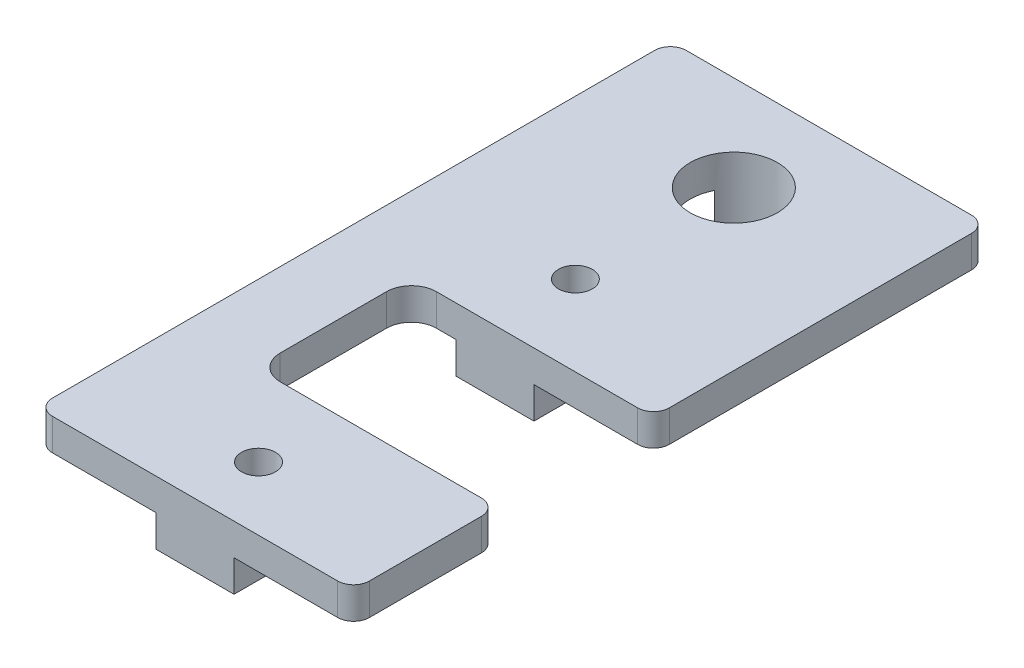
ISO-10303-21;
HEADER;
FILE_DESCRIPTION(('STEP AP214'),'2;1');
FILE_NAME('part.step','',(''),(''),'','','');
FILE_SCHEMA(('AUTOMOTIVE_DESIGN { 1 0 10303 214 1 1 1 1 }'));
ENDSEC;
DATA;
#1=APPLICATION_CONTEXT('core data for automotive mechanical design processes');
#2=APPLICATION_PROTOCOL_DEFINITION('international standard','automotive_design',2000,#1);
#3=PRODUCT_CONTEXT('',#1,'mechanical');
#4=PRODUCT('Part','Part','',(#3));
#5=PRODUCT_RELATED_PRODUCT_CATEGORY('part','',(#4));
#6=PRODUCT_DEFINITION_FORMATION('','',#4);
#7=PRODUCT_DEFINITION_CONTEXT('part definition',#1,'design');
#8=PRODUCT_DEFINITION('design','',#6,#7);
#9=PRODUCT_DEFINITION_SHAPE('','',#8);
#10=(LENGTH_UNIT() NAMED_UNIT(*) SI_UNIT(.MILLI.,.METRE.));
#11=(NAMED_UNIT(*) PLANE_ANGLE_UNIT() SI_UNIT($,.RADIAN.));
#12=(NAMED_UNIT(*) SI_UNIT($,.STERADIAN.) SOLID_ANGLE_UNIT());
#13=UNCERTAINTY_MEASURE_WITH_UNIT(LENGTH_MEASURE(1.E-05),#10,'distance_accuracy_value','');
#14=(GEOMETRIC_REPRESENTATION_CONTEXT(3) GLOBAL_UNCERTAINTY_ASSIGNED_CONTEXT((#13)) GLOBAL_UNIT_ASSIGNED_CONTEXT((#10,
#11,#12)) REPRESENTATION_CONTEXT('',''));
#15=CARTESIAN_POINT('',(0.,0.,0.));
#16=DIRECTION('',(0.,0.,1.));
#17=DIRECTION('',(1.,0.,0.));
#18=AXIS2_PLACEMENT_3D('',#15,#16,#17);
#19=CARTESIAN_POINT('',(19.775,0.,63.5));
#20=DIRECTION('',(1.,0.,0.));
#21=DIRECTION('',(0.,0.,-1.));
#22=AXIS2_PLACEMENT_3D('',#19,#20,#21);
#23=PLANE('',#22);
#24=DIRECTION('',(0.,1.,0.));
#25=VECTOR('',#24,1.);
#26=CARTESIAN_POINT('',(19.775,-3.175,7.5631942908063));
#27=LINE('',#26,#25);
#28=CARTESIAN_POINT('',(19.775,-3.175,7.5631942908063));
#29=VERTEX_POINT('',#28);
#30=CARTESIAN_POINT('',(19.775,0.,7.5631942908063));
#31=VERTEX_POINT('',#30);
#32=EDGE_CURVE('E293',#29,#31,#27,.T.);
#33=ORIENTED_EDGE('',*,*,#32,.F.);
#34=DIRECTION('',(0.,0.,-1.));
#35=VECTOR('',#34,1.);
#36=CARTESIAN_POINT('',(19.775,-3.175,63.5));
#37=LINE('',#36,#35);
#38=CARTESIAN_POINT('',(19.775,-3.175,0.));
#39=VERTEX_POINT('',#38);
#40=EDGE_CURVE('E311',#29,#39,#37,.T.);
#41=ORIENTED_EDGE('',*,*,#40,.T.);
#42=DIRECTION('',(0.,-1.,0.));
#43=VECTOR('',#42,1.);
#44=CARTESIAN_POINT('',(19.775,0.,0.));
#45=LINE('',#44,#43);
#46=CARTESIAN_POINT('',(19.775,0.,0.));
#47=VERTEX_POINT('',#46);
#48=EDGE_CURVE('E295',#47,#39,#45,.T.);
#49=ORIENTED_EDGE('',*,*,#48,.F.);
#50=DIRECTION('',(0.,0.,-1.));
#51=VECTOR('',#50,1.);
#52=CARTESIAN_POINT('',(19.775,0.,63.5));
#53=LINE('',#52,#51);
#54=EDGE_CURVE('E352',#31,#47,#53,.T.);
#55=ORIENTED_EDGE('',*,*,#54,.F.);
#56=EDGE_LOOP('',(#33,#41,#49,#55));
#57=FACE_BOUND('',#56,.T.);
#58=ADVANCED_FACE('F34',(#57),#23,.T.);
#59=CARTESIAN_POINT('',(19.775,-3.175,63.5));
#60=VERTEX_POINT('',#59);
#61=CARTESIAN_POINT('',(19.775,-3.175,49.1));
#62=VERTEX_POINT('',#61);
#63=EDGE_CURVE('E326',#60,#62,#37,.T.);
#64=ORIENTED_EDGE('',*,*,#63,.T.);
#65=DIRECTION('',(0.,1.,0.));
#66=VECTOR('',#65,1.);
#67=CARTESIAN_POINT('',(19.775,0.,49.1));
#68=LINE('',#67,#66);
#69=CARTESIAN_POINT('',(19.775,0.,49.1));
#70=VERTEX_POINT('',#69);
#71=EDGE_CURVE('E265',#62,#70,#68,.T.);
#72=ORIENTED_EDGE('',*,*,#71,.T.);
#73=CARTESIAN_POINT('',(19.775,0.,63.5));
#74=VERTEX_POINT('',#73);
#75=EDGE_CURVE('E353',#74,#70,#53,.T.);
#76=ORIENTED_EDGE('',*,*,#75,.F.);
#77=DIRECTION('',(0.,-1.,0.));
#78=VECTOR('',#77,1.);
#79=CARTESIAN_POINT('',(19.775,0.,63.5));
#80=LINE('',#79,#78);
#81=EDGE_CURVE('E296',#74,#60,#80,.T.);
#82=ORIENTED_EDGE('',*,*,#81,.T.);
#83=EDGE_LOOP('',(#64,#72,#76,#82));
#84=FACE_BOUND('',#83,.T.);
#85=ADVANCED_FACE('F520',(#84),#23,.T.);
#86=CARTESIAN_POINT('',(0.,0.,63.5));
#87=DIRECTION('',(0.,1.,0.));
#88=DIRECTION('',(0.,0.,1.));
#89=AXIS2_PLACEMENT_3D('',#86,#87,#88);
#90=PLANE('',#89);
#91=DIRECTION('',(-1.,0.,0.));
#92=VECTOR('',#91,1.);
#93=CARTESIAN_POINT('',(0.,0.,49.1));
#94=LINE('',#93,#92);
#95=CARTESIAN_POINT('',(30.1625,0.,49.1));
#96=VERTEX_POINT('',#95);
#97=EDGE_CURVE('E263',#96,#70,#94,.T.);
#98=ORIENTED_EDGE('',*,*,#97,.F.);
#99=CARTESIAN_POINT('',(30.1625,0.,50.6875));
#100=DIRECTION('',(0.,1.,0.));
#101=DIRECTION('',(0.,0.,1.));
#102=AXIS2_PLACEMENT_3D('',#99,#100,#101);
#103=CIRCLE('',#102,1.5875);
#104=CARTESIAN_POINT('',(31.75,0.,50.6875));
#105=VERTEX_POINT('',#104);
#106=EDGE_CURVE('E405',#96,#105,#103,.F.);
#107=ORIENTED_EDGE('',*,*,#106,.T.);
#108=DIRECTION('',(0.,0.,-1.));
#109=VECTOR('',#108,1.);
#110=CARTESIAN_POINT('',(31.75,0.,63.5));
#111=LINE('',#110,#109);
#112=CARTESIAN_POINT('',(31.75,0.,61.9125));
#113=VERTEX_POINT('',#112);
#114=EDGE_CURVE('E349',#113,#105,#111,.T.);
#115=ORIENTED_EDGE('',*,*,#114,.F.);
#116=CARTESIAN_POINT('',(30.1625,0.,61.9125));
#117=DIRECTION('',(0.,1.,0.));
#118=DIRECTION('',(0.,0.,1.));
#119=AXIS2_PLACEMENT_3D('',#116,#117,#118);
#120=CIRCLE('',#119,1.5875);
#121=CARTESIAN_POINT('',(30.1625,0.,63.5));
#122=VERTEX_POINT('',#121);
#123=EDGE_CURVE('E403',#113,#122,#120,.F.);
#124=ORIENTED_EDGE('',*,*,#123,.T.);
#125=DIRECTION('',(1.,0.,0.));
#126=VECTOR('',#125,1.);
#127=CARTESIAN_POINT('',(0.,0.,63.5));
#128=LINE('',#127,#126);
#129=EDGE_CURVE('E299',#74,#122,#128,.T.);
#130=ORIENTED_EDGE('',*,*,#129,.F.);
#131=ORIENTED_EDGE('',*,*,#75,.T.);
#132=EDGE_LOOP('',(#98,#107,#115,#124,#130,#131));
#133=FACE_BOUND('',#132,.T.);
#134=ADVANCED_FACE('F526',(#133),#90,.F.);
#135=CARTESIAN_POINT('',(31.75,0.,63.5));
#136=DIRECTION('',(-1.,0.,0.));
#137=DIRECTION('',(0.,0.,1.));
#138=AXIS2_PLACEMENT_3D('',#135,#136,#137);
#139=PLANE('',#138);
#140=ORIENTED_EDGE('',*,*,#114,.T.);
#141=DIRECTION('',(0.,1.,0.));
#142=VECTOR('',#141,1.);
#143=CARTESIAN_POINT('',(31.75,3.175,50.6875));
#144=LINE('',#143,#142);
#145=CARTESIAN_POINT('',(31.75,3.175,50.6875));
#146=VERTEX_POINT('',#145);
#147=EDGE_CURVE('E398',#105,#146,#144,.T.);
#148=ORIENTED_EDGE('',*,*,#147,.T.);
#149=DIRECTION('',(0.,0.,-1.));
#150=VECTOR('',#149,1.);
#151=CARTESIAN_POINT('',(31.75,3.175,63.5));
#152=LINE('',#151,#150);
#153=CARTESIAN_POINT('',(31.75,3.175,61.9125));
#154=VERTEX_POINT('',#153);
#155=EDGE_CURVE('E345',#154,#146,#152,.T.);
#156=ORIENTED_EDGE('',*,*,#155,.F.);
#157=DIRECTION('',(0.,1.,0.));
#158=VECTOR('',#157,1.);
#159=CARTESIAN_POINT('',(31.75,0.,61.9125));
#160=LINE('',#159,#158);
#161=EDGE_CURVE('E396',#154,#113,#160,.F.);
#162=ORIENTED_EDGE('',*,*,#161,.T.);
#163=EDGE_LOOP('',(#140,#148,#156,#162));
#164=FACE_BOUND('',#163,.T.);
#165=ADVANCED_FACE('F450',(#164),#139,.F.);
#166=CARTESIAN_POINT('',(11.975,0.,63.5));
#167=DIRECTION('',(1.,0.,0.));
#168=DIRECTION('',(0.,0.,-1.));
#169=AXIS2_PLACEMENT_3D('',#166,#167,#168);
#170=PLANE('',#169);
#171=DIRECTION('',(0.,0.,-1.));
#172=VECTOR('',#171,1.);
#173=CARTESIAN_POINT('',(11.975,-3.175,63.5));
#174=LINE('',#173,#172);
#175=CARTESIAN_POINT('',(11.975,-3.175,7.5631942908063));
#176=VERTEX_POINT('',#175);
#177=CARTESIAN_POINT('',(11.975,-3.175,0.));
#178=VERTEX_POINT('',#177);
#179=EDGE_CURVE('E329',#176,#178,#174,.T.);
#180=ORIENTED_EDGE('',*,*,#179,.F.);
#181=DIRECTION('',(0.,1.,0.));
#182=VECTOR('',#181,1.);
#183=CARTESIAN_POINT('',(11.975,-3.175,7.5631942908063));
#184=LINE('',#183,#182);
#185=CARTESIAN_POINT('',(11.975,0.,7.5631942908063));
#186=VERTEX_POINT('',#185);
#187=EDGE_CURVE('E285',#176,#186,#184,.T.);
#188=ORIENTED_EDGE('',*,*,#187,.T.);
#189=DIRECTION('',(0.,0.,-1.));
#190=VECTOR('',#189,1.);
#191=CARTESIAN_POINT('',(11.975,0.,63.5));
#192=LINE('',#191,#190);
#193=CARTESIAN_POINT('',(11.975,0.,0.));
#194=VERTEX_POINT('',#193);
#195=EDGE_CURVE('E334',#186,#194,#192,.T.);
#196=ORIENTED_EDGE('',*,*,#195,.T.);
#197=DIRECTION('',(0.,-1.,0.));
#198=VECTOR('',#197,1.);
#199=CARTESIAN_POINT('',(11.975,0.,0.));
#200=LINE('',#199,#198);
#201=EDGE_CURVE('E321',#194,#178,#200,.T.);
#202=ORIENTED_EDGE('',*,*,#201,.T.);
#203=EDGE_LOOP('',(#180,#188,#196,#202));
#204=FACE_BOUND('',#203,.T.);
#205=ADVANCED_FACE('F497',(#204),#170,.F.);
#206=DIRECTION('',(0.,1.,0.));
#207=VECTOR('',#206,1.);
#208=CARTESIAN_POINT('',(11.975,0.,49.1));
#209=LINE('',#208,#207);
#210=CARTESIAN_POINT('',(11.975,-3.175,49.1));
#211=VERTEX_POINT('',#210);
#212=CARTESIAN_POINT('',(11.975,0.,49.1));
#213=VERTEX_POINT('',#212);
#214=EDGE_CURVE('E255',#211,#213,#209,.T.);
#215=ORIENTED_EDGE('',*,*,#214,.F.);
#216=CARTESIAN_POINT('',(11.975,-3.175,63.5));
#217=VERTEX_POINT('',#216);
#218=EDGE_CURVE('E331',#217,#211,#174,.T.);
#219=ORIENTED_EDGE('',*,*,#218,.F.);
#220=DIRECTION('',(0.,-1.,0.));
#221=VECTOR('',#220,1.);
#222=CARTESIAN_POINT('',(11.975,0.,63.5));
#223=LINE('',#222,#221);
#224=CARTESIAN_POINT('',(11.975,0.,63.5));
#225=VERTEX_POINT('',#224);
#226=EDGE_CURVE('E307',#225,#217,#223,.T.);
#227=ORIENTED_EDGE('',*,*,#226,.F.);
#228=EDGE_CURVE('E336',#225,#213,#192,.T.);
#229=ORIENTED_EDGE('',*,*,#228,.T.);
#230=EDGE_LOOP('',(#215,#219,#227,#229));
#231=FACE_BOUND('',#230,.T.);
#232=ADVANCED_FACE('F545',(#231),#170,.F.);
#233=CARTESIAN_POINT('',(0.,-3.175,63.5));
#234=DIRECTION('',(0.,1.,0.));
#235=DIRECTION('',(0.,0.,1.));
#236=AXIS2_PLACEMENT_3D('',#233,#234,#235);
#237=PLANE('',#236);
#238=ORIENTED_EDGE('',*,*,#40,.F.);
#239=CARTESIAN_POINT('',(15.875,-3.175,9.525));
#240=DIRECTION('',(0.,1.,0.));
#241=DIRECTION('',(0.,0.,1.));
#242=AXIS2_PLACEMENT_3D('',#239,#240,#241);
#243=CIRCLE('',#242,4.365625);
#244=EDGE_CURVE('E365',#29,#176,#243,.T.);
#245=ORIENTED_EDGE('',*,*,#244,.T.);
#246=ORIENTED_EDGE('',*,*,#179,.T.);
#247=DIRECTION('',(1.,0.,0.));
#248=VECTOR('',#247,1.);
#249=CARTESIAN_POINT('',(0.,-3.175,0.));
#250=LINE('',#249,#248);
#251=EDGE_CURVE('E300',#178,#39,#250,.T.);
#252=ORIENTED_EDGE('',*,*,#251,.T.);
#253=EDGE_LOOP('',(#238,#245,#246,#252));
#254=FACE_BOUND('',#253,.T.);
#255=ADVANCED_FACE('F494',(#254),#237,.F.);
#256=CARTESIAN_POINT('',(15.875,-3.175,57.15));
#257=DIRECTION('',(0.,1.,0.));
#258=DIRECTION('',(0.,0.,1.));
#259=AXIS2_PLACEMENT_3D('',#256,#257,#258);
#260=CIRCLE('',#259,1.7);
#261=CARTESIAN_POINT('',(15.875,-3.175,58.85));
#262=VERTEX_POINT('',#261);
#263=EDGE_CURVE('E801',#262,#262,#260,.T.);
#264=ORIENTED_EDGE('',*,*,#263,.T.);
#265=EDGE_LOOP('',(#264));
#266=FACE_BOUND('',#265,.T.);
#267=DIRECTION('',(-1.,0.,0.));
#268=VECTOR('',#267,1.);
#269=CARTESIAN_POINT('',(0.,-3.175,49.1));
#270=LINE('',#269,#268);
#271=EDGE_CURVE('E356',#62,#211,#270,.T.);
#272=ORIENTED_EDGE('',*,*,#271,.F.);
#273=ORIENTED_EDGE('',*,*,#63,.F.);
#274=DIRECTION('',(1.,0.,0.));
#275=VECTOR('',#274,1.);
#276=CARTESIAN_POINT('',(0.,-3.175,63.5));
#277=LINE('',#276,#275);
#278=EDGE_CURVE('E309',#217,#60,#277,.T.);
#279=ORIENTED_EDGE('',*,*,#278,.F.);
#280=ORIENTED_EDGE('',*,*,#218,.T.);
#281=EDGE_LOOP('',(#272,#273,#279,#280));
#282=FACE_BOUND('',#281,.T.);
#283=ADVANCED_FACE('F518',(#266,#282),#237,.F.);
#284=DIRECTION('',(0.,1.,0.));
#285=VECTOR('',#284,1.);
#286=CARTESIAN_POINT('',(19.775,-3.175,11.4868057091937));
#287=LINE('',#286,#285);
#288=CARTESIAN_POINT('',(19.775,0.,11.4868057091937));
#289=VERTEX_POINT('',#288);
#290=CARTESIAN_POINT('',(19.775,-3.175,11.4868057091937));
#291=VERTEX_POINT('',#290);
#292=EDGE_CURVE('E291',#289,#291,#287,.F.);
#293=ORIENTED_EDGE('',*,*,#292,.F.);
#294=CARTESIAN_POINT('',(19.775,0.,33.45));
#295=VERTEX_POINT('',#294);
#296=EDGE_CURVE('E357',#295,#289,#53,.T.);
#297=ORIENTED_EDGE('',*,*,#296,.F.);
#298=DIRECTION('',(0.,1.,0.));
#299=VECTOR('',#298,1.);
#300=CARTESIAN_POINT('',(19.775,0.,33.45));
#301=LINE('',#300,#299);
#302=CARTESIAN_POINT('',(19.775,-3.175,33.45));
#303=VERTEX_POINT('',#302);
#304=EDGE_CURVE('E276',#303,#295,#301,.T.);
#305=ORIENTED_EDGE('',*,*,#304,.F.);
#306=EDGE_CURVE('E330',#303,#291,#37,.T.);
#307=ORIENTED_EDGE('',*,*,#306,.T.);
#308=EDGE_LOOP('',(#293,#297,#305,#307));
#309=FACE_BOUND('',#308,.T.);
#310=ADVANCED_FACE('F514',(#309),#23,.T.);
#311=CARTESIAN_POINT('',(31.75,0.,31.8625));
#312=VERTEX_POINT('',#311);
#313=CARTESIAN_POINT('',(31.75,0.,1.5875));
#314=VERTEX_POINT('',#313);
#315=EDGE_CURVE('E348',#312,#314,#111,.T.);
#316=ORIENTED_EDGE('',*,*,#315,.F.);
#317=CARTESIAN_POINT('',(30.1625,0.,31.8625));
#318=DIRECTION('',(0.,1.,0.));
#319=DIRECTION('',(0.,0.,1.));
#320=AXIS2_PLACEMENT_3D('',#317,#318,#319);
#321=CIRCLE('',#320,1.5875);
#322=CARTESIAN_POINT('',(30.1625,0.,33.45));
#323=VERTEX_POINT('',#322);
#324=EDGE_CURVE('E394',#312,#323,#321,.F.);
#325=ORIENTED_EDGE('',*,*,#324,.T.);
#326=DIRECTION('',(-1.,0.,0.));
#327=VECTOR('',#326,1.);
#328=CARTESIAN_POINT('',(0.,0.,33.45));
#329=LINE('',#328,#327);
#330=EDGE_CURVE('E274',#323,#295,#329,.T.);
#331=ORIENTED_EDGE('',*,*,#330,.T.);
#332=ORIENTED_EDGE('',*,*,#296,.T.);
#333=CARTESIAN_POINT('',(15.875,0.,9.525));
#334=DIRECTION('',(0.,1.,0.));
#335=DIRECTION('',(0.,0.,1.));
#336=AXIS2_PLACEMENT_3D('',#333,#334,#335);
#337=CIRCLE('',#336,4.365625);
#338=EDGE_CURVE('E288',#289,#31,#337,.T.);
#339=ORIENTED_EDGE('',*,*,#338,.T.);
#340=ORIENTED_EDGE('',*,*,#54,.T.);
#341=DIRECTION('',(1.,0.,0.));
#342=VECTOR('',#341,1.);
#343=CARTESIAN_POINT('',(0.,0.,0.));
#344=LINE('',#343,#342);
#345=CARTESIAN_POINT('',(30.1625,0.,0.));
#346=VERTEX_POINT('',#345);
#347=EDGE_CURVE('E314',#47,#346,#344,.T.);
#348=ORIENTED_EDGE('',*,*,#347,.T.);
#349=CARTESIAN_POINT('',(30.1625,0.,1.5875));
#350=DIRECTION('',(0.,1.,0.));
#351=DIRECTION('',(0.,0.,1.));
#352=AXIS2_PLACEMENT_3D('',#349,#350,#351);
#353=CIRCLE('',#352,1.5875);
#354=EDGE_CURVE('E392',#346,#314,#353,.F.);
#355=ORIENTED_EDGE('',*,*,#354,.T.);
#356=EDGE_LOOP('',(#316,#325,#331,#332,#339,#340,#348,#355));
#357=FACE_BOUND('',#356,.T.);
#358=ADVANCED_FACE('F481',(#357),#90,.F.);
#359=CARTESIAN_POINT('',(31.75,3.175,31.8625));
#360=VERTEX_POINT('',#359);
#361=CARTESIAN_POINT('',(31.75,3.175,1.5875));
#362=VERTEX_POINT('',#361);
#363=EDGE_CURVE('E344',#360,#362,#152,.T.);
#364=ORIENTED_EDGE('',*,*,#363,.F.);
#365=DIRECTION('',(0.,1.,0.));
#366=VECTOR('',#365,1.);
#367=CARTESIAN_POINT('',(31.75,0.,31.8625));
#368=LINE('',#367,#366);
#369=EDGE_CURVE('E390',#360,#312,#368,.F.);
#370=ORIENTED_EDGE('',*,*,#369,.T.);
#371=ORIENTED_EDGE('',*,*,#315,.T.);
#372=DIRECTION('',(0.,1.,0.));
#373=VECTOR('',#372,1.);
#374=CARTESIAN_POINT('',(31.75,0.,1.5875));
#375=LINE('',#374,#373);
#376=EDGE_CURVE('E387',#314,#362,#375,.T.);
#377=ORIENTED_EDGE('',*,*,#376,.T.);
#378=EDGE_LOOP('',(#364,#370,#371,#377));
#379=FACE_BOUND('',#378,.T.);
#380=ADVANCED_FACE('F478',(#379),#139,.F.);
#381=CARTESIAN_POINT('',(0.,3.175,63.5));
#382=DIRECTION('',(0.,1.,0.));
#383=DIRECTION('',(0.,0.,1.));
#384=AXIS2_PLACEMENT_3D('',#381,#382,#383);
#385=PLANE('',#384);
#386=CARTESIAN_POINT('',(15.875,3.175,57.15));
#387=DIRECTION('',(0.,1.,0.));
#388=DIRECTION('',(0.,0.,1.));
#389=AXIS2_PLACEMENT_3D('',#386,#387,#388);
#390=CIRCLE('',#389,1.7);
#391=CARTESIAN_POINT('',(15.875,3.175,58.85));
#392=VERTEX_POINT('',#391);
#393=EDGE_CURVE('E804',#392,#392,#390,.T.);
#394=ORIENTED_EDGE('',*,*,#393,.F.);
#395=EDGE_LOOP('',(#394));
#396=FACE_BOUND('',#395,.T.);
#397=CARTESIAN_POINT('',(15.875,3.175,9.525));
#398=DIRECTION('',(0.,1.,0.));
#399=DIRECTION('',(0.,0.,1.));
#400=AXIS2_PLACEMENT_3D('',#397,#398,#399);
#401=CIRCLE('',#400,4.365625);
#402=CARTESIAN_POINT('',(15.875,3.175,13.890625));
#403=VERTEX_POINT('',#402);
#404=EDGE_CURVE('E805',#403,#403,#401,.T.);
#405=ORIENTED_EDGE('',*,*,#404,.F.);
#406=EDGE_LOOP('',(#405));
#407=FACE_BOUND('',#406,.T.);
#408=CARTESIAN_POINT('',(15.875,3.175,25.4));
#409=DIRECTION('',(0.,1.,0.));
#410=DIRECTION('',(0.,0.,1.));
#411=AXIS2_PLACEMENT_3D('',#408,#409,#410);
#412=CIRCLE('',#411,1.7);
#413=CARTESIAN_POINT('',(15.875,3.175,27.1));
#414=VERTEX_POINT('',#413);
#415=EDGE_CURVE('E240',#414,#414,#412,.T.);
#416=ORIENTED_EDGE('',*,*,#415,.F.);
#417=EDGE_LOOP('',(#416));
#418=FACE_BOUND('',#417,.T.);
#419=DIRECTION('',(-1.,0.,0.));
#420=VECTOR('',#419,1.);
#421=CARTESIAN_POINT('',(0.,3.175,33.45));
#422=LINE('',#421,#420);
#423=CARTESIAN_POINT('',(30.1625,3.175,33.45));
#424=VERTEX_POINT('',#423);
#425=CARTESIAN_POINT('',(10.,3.175,33.45));
#426=VERTEX_POINT('',#425);
#427=EDGE_CURVE('E248',#424,#426,#422,.T.);
#428=ORIENTED_EDGE('',*,*,#427,.F.);
#429=CARTESIAN_POINT('',(30.1625,3.175,31.8625));
#430=DIRECTION('',(0.,1.,0.));
#431=DIRECTION('',(0.,0.,1.));
#432=AXIS2_PLACEMENT_3D('',#429,#430,#431);
#433=CIRCLE('',#432,1.5875);
#434=EDGE_CURVE('E385',#424,#360,#433,.T.);
#435=ORIENTED_EDGE('',*,*,#434,.T.);
#436=ORIENTED_EDGE('',*,*,#363,.T.);
#437=CARTESIAN_POINT('',(30.1625,3.175,1.5875));
#438=DIRECTION('',(0.,1.,0.));
#439=DIRECTION('',(0.,0.,1.));
#440=AXIS2_PLACEMENT_3D('',#437,#438,#439);
#441=CIRCLE('',#440,1.5875);
#442=CARTESIAN_POINT('',(30.1625,3.175,0.));
#443=VERTEX_POINT('',#442);
#444=EDGE_CURVE('E381',#362,#443,#441,.T.);
#445=ORIENTED_EDGE('',*,*,#444,.T.);
#446=DIRECTION('',(1.,0.,0.));
#447=VECTOR('',#446,1.);
#448=CARTESIAN_POINT('',(0.,3.175,0.));
#449=LINE('',#448,#447);
#450=CARTESIAN_POINT('',(1.5875,3.175,0.));
#451=VERTEX_POINT('',#450);
#452=EDGE_CURVE('E317',#451,#443,#449,.T.);
#453=ORIENTED_EDGE('',*,*,#452,.F.);
#454=CARTESIAN_POINT('',(1.5875,3.175,1.5875));
#455=DIRECTION('',(0.,1.,0.));
#456=DIRECTION('',(0.,0.,1.));
#457=AXIS2_PLACEMENT_3D('',#454,#455,#456);
#458=CIRCLE('',#457,1.5875);
#459=CARTESIAN_POINT('',(0.,3.175,1.5875));
#460=VERTEX_POINT('',#459);
#461=EDGE_CURVE('E375',#451,#460,#458,.T.);
#462=ORIENTED_EDGE('',*,*,#461,.T.);
#463=DIRECTION('',(0.,0.,-1.));
#464=VECTOR('',#463,1.);
#465=CARTESIAN_POINT('',(0.,3.175,63.5));
#466=LINE('',#465,#464);
#467=CARTESIAN_POINT('',(0.,3.175,61.9125));
#468=VERTEX_POINT('',#467);
#469=EDGE_CURVE('E342',#468,#460,#466,.T.);
#470=ORIENTED_EDGE('',*,*,#469,.F.);
#471=CARTESIAN_POINT('',(1.5875,3.175,61.9125));
#472=DIRECTION('',(0.,1.,0.));
#473=DIRECTION('',(0.,0.,1.));
#474=AXIS2_PLACEMENT_3D('',#471,#472,#473);
#475=CIRCLE('',#474,1.5875);
#476=CARTESIAN_POINT('',(1.5875,3.175,63.5));
#477=VERTEX_POINT('',#476);
#478=EDGE_CURVE('E377',#468,#477,#475,.T.);
#479=ORIENTED_EDGE('',*,*,#478,.T.);
#480=DIRECTION('',(1.,0.,0.));
#481=VECTOR('',#480,1.);
#482=CARTESIAN_POINT('',(0.,3.175,63.5));
#483=LINE('',#482,#481);
#484=CARTESIAN_POINT('',(30.1625,3.175,63.5));
#485=VERTEX_POINT('',#484);
#486=EDGE_CURVE('E303',#477,#485,#483,.T.);
#487=ORIENTED_EDGE('',*,*,#486,.T.);
#488=CARTESIAN_POINT('',(30.1625,3.175,61.9125));
#489=DIRECTION('',(0.,1.,0.));
#490=DIRECTION('',(0.,0.,1.));
#491=AXIS2_PLACEMENT_3D('',#488,#489,#490);
#492=CIRCLE('',#491,1.5875);
#493=EDGE_CURVE('E379',#485,#154,#492,.T.);
#494=ORIENTED_EDGE('',*,*,#493,.T.);
#495=ORIENTED_EDGE('',*,*,#155,.T.);
#496=CARTESIAN_POINT('',(30.1625,3.175,50.6875));
#497=DIRECTION('',(0.,1.,0.));
#498=DIRECTION('',(0.,0.,1.));
#499=AXIS2_PLACEMENT_3D('',#496,#497,#498);
#500=CIRCLE('',#499,1.5875);
#501=CARTESIAN_POINT('',(30.1625,3.175,49.1));
#502=VERTEX_POINT('',#501);
#503=EDGE_CURVE('E383',#146,#502,#500,.T.);
#504=ORIENTED_EDGE('',*,*,#503,.T.);
#505=DIRECTION('',(-1.,0.,0.));
#506=VECTOR('',#505,1.);
#507=CARTESIAN_POINT('',(0.,3.175,49.1));
#508=LINE('',#507,#506);
#509=CARTESIAN_POINT('',(10.,3.175,49.1));
#510=VERTEX_POINT('',#509);
#511=EDGE_CURVE('E245',#502,#510,#508,.T.);
#512=ORIENTED_EDGE('',*,*,#511,.T.);
#513=CARTESIAN_POINT('',(10.,3.175,46.6));
#514=DIRECTION('',(0.,1.,0.));
#515=DIRECTION('',(0.,0.,1.));
#516=AXIS2_PLACEMENT_3D('',#513,#514,#515);
#517=CIRCLE('',#516,2.5);
#518=CARTESIAN_POINT('',(7.5,3.175,46.6));
#519=VERTEX_POINT('',#518);
#520=EDGE_CURVE('E224',#519,#510,#517,.T.);
#521=ORIENTED_EDGE('',*,*,#520,.F.);
#522=DIRECTION('',(0.,0.,1.));
#523=VECTOR('',#522,1.);
#524=CARTESIAN_POINT('',(7.5,3.175,0.));
#525=LINE('',#524,#523);
#526=CARTESIAN_POINT('',(7.5,3.175,35.95));
#527=VERTEX_POINT('',#526);
#528=EDGE_CURVE('E233',#527,#519,#525,.T.);
#529=ORIENTED_EDGE('',*,*,#528,.F.);
#530=CARTESIAN_POINT('',(10.,3.175,35.95));
#531=DIRECTION('',(0.,1.,0.));
#532=DIRECTION('',(0.,0.,1.));
#533=AXIS2_PLACEMENT_3D('',#530,#531,#532);
#534=CIRCLE('',#533,2.5);
#535=EDGE_CURVE('E230',#426,#527,#534,.T.);
#536=ORIENTED_EDGE('',*,*,#535,.F.);
#537=EDGE_LOOP('',(#428,#435,#436,#445,#453,#462,#470,#479,#487,#494,#495,#504,#512,#521,#529,#536));
#538=FACE_BOUND('',#537,.T.);
#539=ADVANCED_FACE('F243',(#396,#407,#418,#538),#385,.T.);
#540=CARTESIAN_POINT('',(0.,0.,63.5));
#541=DIRECTION('',(-1.,0.,0.));
#542=DIRECTION('',(0.,0.,1.));
#543=AXIS2_PLACEMENT_3D('',#540,#541,#542);
#544=PLANE('',#543);
#545=DIRECTION('',(0.,0.,-1.));
#546=VECTOR('',#545,1.);
#547=CARTESIAN_POINT('',(0.,0.,63.5));
#548=LINE('',#547,#546);
#549=CARTESIAN_POINT('',(0.,0.,61.9125));
#550=VERTEX_POINT('',#549);
#551=CARTESIAN_POINT('',(0.,0.,1.5875));
#552=VERTEX_POINT('',#551);
#553=EDGE_CURVE('E339',#550,#552,#548,.T.);
#554=ORIENTED_EDGE('',*,*,#553,.F.);
#555=DIRECTION('',(0.,1.,0.));
#556=VECTOR('',#555,1.);
#557=CARTESIAN_POINT('',(0.,0.,61.9125));
#558=LINE('',#557,#556);
#559=EDGE_CURVE('E418',#550,#468,#558,.T.);
#560=ORIENTED_EDGE('',*,*,#559,.T.);
#561=ORIENTED_EDGE('',*,*,#469,.T.);
#562=DIRECTION('',(0.,1.,0.));
#563=VECTOR('',#562,1.);
#564=CARTESIAN_POINT('',(0.,0.,1.5875));
#565=LINE('',#564,#563);
#566=EDGE_CURVE('E49',#460,#552,#565,.F.);
#567=ORIENTED_EDGE('',*,*,#566,.T.);
#568=EDGE_LOOP('',(#554,#560,#561,#567));
#569=FACE_BOUND('',#568,.T.);
#570=ADVANCED_FACE('F433',(#569),#544,.T.);
#571=CARTESIAN_POINT('',(1.5875,0.,63.5));
#572=VERTEX_POINT('',#571);
#573=EDGE_CURVE('E304',#572,#225,#128,.T.);
#574=ORIENTED_EDGE('',*,*,#573,.F.);
#575=CARTESIAN_POINT('',(1.5875,0.,61.9125));
#576=DIRECTION('',(0.,1.,0.));
#577=DIRECTION('',(0.,0.,1.));
#578=AXIS2_PLACEMENT_3D('',#575,#576,#577);
#579=CIRCLE('',#578,1.5875);
#580=EDGE_CURVE('E11',#572,#550,#579,.F.);
#581=ORIENTED_EDGE('',*,*,#580,.T.);
#582=ORIENTED_EDGE('',*,*,#553,.T.);
#583=CARTESIAN_POINT('',(1.5875,0.,1.5875));
#584=DIRECTION('',(0.,1.,0.));
#585=DIRECTION('',(0.,0.,1.));
#586=AXIS2_PLACEMENT_3D('',#583,#584,#585);
#587=CIRCLE('',#586,1.5875);
#588=CARTESIAN_POINT('',(1.5875,0.,0.));
#589=VERTEX_POINT('',#588);
#590=EDGE_CURVE('E42',#552,#589,#587,.F.);
#591=ORIENTED_EDGE('',*,*,#590,.T.);
#592=EDGE_CURVE('E318',#589,#194,#344,.T.);
#593=ORIENTED_EDGE('',*,*,#592,.T.);
#594=ORIENTED_EDGE('',*,*,#195,.F.);
#595=CARTESIAN_POINT('',(15.875,0.,9.525));
#596=DIRECTION('',(0.,1.,0.));
#597=DIRECTION('',(0.,0.,1.));
#598=AXIS2_PLACEMENT_3D('',#595,#596,#597);
#599=CIRCLE('',#598,4.365625);
#600=CARTESIAN_POINT('',(11.975,0.,11.4868057091937));
#601=VERTEX_POINT('',#600);
#602=EDGE_CURVE('E282',#186,#601,#599,.T.);
#603=ORIENTED_EDGE('',*,*,#602,.T.);
#604=CARTESIAN_POINT('',(11.975,0.,33.45));
#605=VERTEX_POINT('',#604);
#606=EDGE_CURVE('E340',#605,#601,#192,.T.);
#607=ORIENTED_EDGE('',*,*,#606,.F.);
#608=DIRECTION('',(-1.,0.,0.));
#609=VECTOR('',#608,1.);
#610=CARTESIAN_POINT('',(0.,0.,33.45));
#611=LINE('',#610,#609);
#612=CARTESIAN_POINT('',(10.,0.,33.45));
#613=VERTEX_POINT('',#612);
#614=EDGE_CURVE('E271',#605,#613,#611,.T.);
#615=ORIENTED_EDGE('',*,*,#614,.T.);
#616=CARTESIAN_POINT('',(10.,0.,35.95));
#617=DIRECTION('',(0.,1.,0.));
#618=DIRECTION('',(0.,0.,1.));
#619=AXIS2_PLACEMENT_3D('',#616,#617,#618);
#620=CIRCLE('',#619,2.5);
#621=CARTESIAN_POINT('',(7.5,0.,35.95));
#622=VERTEX_POINT('',#621);
#623=EDGE_CURVE('E369',#613,#622,#620,.T.);
#624=ORIENTED_EDGE('',*,*,#623,.T.);
#625=DIRECTION('',(0.,0.,1.));
#626=VECTOR('',#625,1.);
#627=CARTESIAN_POINT('',(7.5,0.,63.5));
#628=LINE('',#627,#626);
#629=CARTESIAN_POINT('',(7.5,0.,46.6));
#630=VERTEX_POINT('',#629);
#631=EDGE_CURVE('E367',#622,#630,#628,.T.);
#632=ORIENTED_EDGE('',*,*,#631,.T.);
#633=CARTESIAN_POINT('',(10.,0.,46.6));
#634=DIRECTION('',(0.,1.,0.));
#635=DIRECTION('',(0.,0.,1.));
#636=AXIS2_PLACEMENT_3D('',#633,#634,#635);
#637=CIRCLE('',#636,2.5);
#638=CARTESIAN_POINT('',(10.,0.,49.1));
#639=VERTEX_POINT('',#638);
#640=EDGE_CURVE('E226',#630,#639,#637,.T.);
#641=ORIENTED_EDGE('',*,*,#640,.T.);
#642=DIRECTION('',(-1.,0.,0.));
#643=VECTOR('',#642,1.);
#644=CARTESIAN_POINT('',(0.,0.,49.1));
#645=LINE('',#644,#643);
#646=EDGE_CURVE('E261',#213,#639,#645,.T.);
#647=ORIENTED_EDGE('',*,*,#646,.F.);
#648=ORIENTED_EDGE('',*,*,#228,.F.);
#649=EDGE_LOOP('',(#574,#581,#582,#591,#593,#594,#603,#607,#615,#624,#632,#641,#647,#648));
#650=FACE_BOUND('',#649,.T.);
#651=ADVANCED_FACE('F422',(#650),#90,.F.);
#652=ORIENTED_EDGE('',*,*,#606,.T.);
#653=DIRECTION('',(0.,1.,0.));
#654=VECTOR('',#653,1.);
#655=CARTESIAN_POINT('',(11.975,-3.175,11.4868057091937));
#656=LINE('',#655,#654);
#657=CARTESIAN_POINT('',(11.975,-3.175,11.4868057091937));
#658=VERTEX_POINT('',#657);
#659=EDGE_CURVE('E279',#601,#658,#656,.F.);
#660=ORIENTED_EDGE('',*,*,#659,.T.);
#661=CARTESIAN_POINT('',(11.975,-3.175,33.45));
#662=VERTEX_POINT('',#661);
#663=EDGE_CURVE('E335',#662,#658,#174,.T.);
#664=ORIENTED_EDGE('',*,*,#663,.F.);
#665=DIRECTION('',(0.,1.,0.));
#666=VECTOR('',#665,1.);
#667=CARTESIAN_POINT('',(11.975,0.,33.45));
#668=LINE('',#667,#666);
#669=EDGE_CURVE('E268',#662,#605,#668,.T.);
#670=ORIENTED_EDGE('',*,*,#669,.T.);
#671=EDGE_LOOP('',(#652,#660,#664,#670));
#672=FACE_BOUND('',#671,.T.);
#673=ADVANCED_FACE('F501',(#672),#170,.F.);
#674=CARTESIAN_POINT('',(15.875,-3.175,25.4));
#675=DIRECTION('',(0.,1.,0.));
#676=DIRECTION('',(0.,0.,1.));
#677=AXIS2_PLACEMENT_3D('',#674,#675,#676);
#678=CIRCLE('',#677,1.7);
#679=CARTESIAN_POINT('',(15.875,-3.175,27.1));
#680=VERTEX_POINT('',#679);
#681=EDGE_CURVE('E808',#680,#680,#678,.T.);
#682=ORIENTED_EDGE('',*,*,#681,.T.);
#683=EDGE_LOOP('',(#682));
#684=FACE_BOUND('',#683,.T.);
#685=ORIENTED_EDGE('',*,*,#663,.T.);
#686=EDGE_CURVE('E362',#658,#291,#243,.T.);
#687=ORIENTED_EDGE('',*,*,#686,.T.);
#688=ORIENTED_EDGE('',*,*,#306,.F.);
#689=DIRECTION('',(-1.,0.,0.));
#690=VECTOR('',#689,1.);
#691=CARTESIAN_POINT('',(0.,-3.175,33.45));
#692=LINE('',#691,#690);
#693=EDGE_CURVE('E359',#303,#662,#692,.T.);
#694=ORIENTED_EDGE('',*,*,#693,.T.);
#695=EDGE_LOOP('',(#685,#687,#688,#694));
#696=FACE_BOUND('',#695,.T.);
#697=ADVANCED_FACE('F511',(#684,#696),#237,.F.);
#698=CARTESIAN_POINT('',(0.,0.,63.5));
#699=DIRECTION('',(0.,0.,1.));
#700=DIRECTION('',(1.,0.,0.));
#701=AXIS2_PLACEMENT_3D('',#698,#699,#700);
#702=PLANE('',#701);
#703=ORIENTED_EDGE('',*,*,#129,.T.);
#704=DIRECTION('',(0.,1.,0.));
#705=VECTOR('',#704,1.);
#706=CARTESIAN_POINT('',(30.1625,3.175,63.5));
#707=LINE('',#706,#705);
#708=EDGE_CURVE('E414',#122,#485,#707,.T.);
#709=ORIENTED_EDGE('',*,*,#708,.T.);
#710=ORIENTED_EDGE('',*,*,#486,.F.);
#711=DIRECTION('',(0.,1.,0.));
#712=VECTOR('',#711,1.);
#713=CARTESIAN_POINT('',(1.5875,0.,63.5));
#714=LINE('',#713,#712);
#715=EDGE_CURVE('E412',#477,#572,#714,.F.);
#716=ORIENTED_EDGE('',*,*,#715,.T.);
#717=ORIENTED_EDGE('',*,*,#573,.T.);
#718=ORIENTED_EDGE('',*,*,#226,.T.);
#719=ORIENTED_EDGE('',*,*,#278,.T.);
#720=ORIENTED_EDGE('',*,*,#81,.F.);
#721=EDGE_LOOP('',(#703,#709,#710,#716,#717,#718,#719,#720));
#722=FACE_BOUND('',#721,.T.);
#723=ADVANCED_FACE('F440',(#722),#702,.T.);
#724=CARTESIAN_POINT('',(0.,0.,0.));
#725=DIRECTION('',(0.,0.,1.));
#726=DIRECTION('',(1.,0.,0.));
#727=AXIS2_PLACEMENT_3D('',#724,#725,#726);
#728=PLANE('',#727);
#729=ORIENTED_EDGE('',*,*,#452,.T.);
#730=DIRECTION('',(0.,1.,0.));
#731=VECTOR('',#730,1.);
#732=CARTESIAN_POINT('',(30.1625,0.,0.));
#733=LINE('',#732,#731);
#734=EDGE_CURVE('E410',#443,#346,#733,.F.);
#735=ORIENTED_EDGE('',*,*,#734,.T.);
#736=ORIENTED_EDGE('',*,*,#347,.F.);
#737=ORIENTED_EDGE('',*,*,#48,.T.);
#738=ORIENTED_EDGE('',*,*,#251,.F.);
#739=ORIENTED_EDGE('',*,*,#201,.F.);
#740=ORIENTED_EDGE('',*,*,#592,.F.);
#741=DIRECTION('',(0.,1.,0.));
#742=VECTOR('',#741,1.);
#743=CARTESIAN_POINT('',(1.5875,3.175,0.));
#744=LINE('',#743,#742);
#745=EDGE_CURVE('E407',#589,#451,#744,.T.);
#746=ORIENTED_EDGE('',*,*,#745,.T.);
#747=EDGE_LOOP('',(#729,#735,#736,#737,#738,#739,#740,#746));
#748=FACE_BOUND('',#747,.T.);
#749=ADVANCED_FACE('F429',(#748),#728,.F.);
#750=CARTESIAN_POINT('',(7.5,-3.175,0.));
#751=DIRECTION('',(-1.,0.,0.));
#752=DIRECTION('',(0.,0.,1.));
#753=AXIS2_PLACEMENT_3D('',#750,#751,#752);
#754=PLANE('',#753);
#755=DIRECTION('',(0.,1.,0.));
#756=VECTOR('',#755,1.);
#757=CARTESIAN_POINT('',(7.5,-3.175,35.95));
#758=LINE('',#757,#756);
#759=EDGE_CURVE('E236',#622,#527,#758,.T.);
#760=ORIENTED_EDGE('',*,*,#759,.T.);
#761=ORIENTED_EDGE('',*,*,#528,.T.);
#762=DIRECTION('',(0.,1.,0.));
#763=VECTOR('',#762,1.);
#764=CARTESIAN_POINT('',(7.5,-3.175,46.6));
#765=LINE('',#764,#763);
#766=EDGE_CURVE('E219',#630,#519,#765,.T.);
#767=ORIENTED_EDGE('',*,*,#766,.F.);
#768=ORIENTED_EDGE('',*,*,#631,.F.);
#769=EDGE_LOOP('',(#760,#761,#767,#768));
#770=FACE_BOUND('',#769,.T.);
#771=ADVANCED_FACE('F234',(#770),#754,.F.);
#772=CARTESIAN_POINT('',(10.,-3.175,35.95));
#773=DIRECTION('',(0.,1.,0.));
#774=DIRECTION('',(0.,0.,1.));
#775=AXIS2_PLACEMENT_3D('',#772,#773,#774);
#776=CYLINDRICAL_SURFACE('',#775,2.5);
#777=DIRECTION('',(0.,1.,0.));
#778=VECTOR('',#777,1.);
#779=CARTESIAN_POINT('',(10.,-3.175,33.45));
#780=LINE('',#779,#778);
#781=EDGE_CURVE('E256',#613,#426,#780,.T.);
#782=ORIENTED_EDGE('',*,*,#781,.T.);
#783=ORIENTED_EDGE('',*,*,#535,.T.);
#784=ORIENTED_EDGE('',*,*,#759,.F.);
#785=ORIENTED_EDGE('',*,*,#623,.F.);
#786=EDGE_LOOP('',(#782,#783,#784,#785));
#787=FACE_BOUND('',#786,.T.);
#788=ADVANCED_FACE('F463',(#787),#776,.F.);
#789=CARTESIAN_POINT('',(10.,-3.175,46.6));
#790=DIRECTION('',(0.,1.,0.));
#791=DIRECTION('',(0.,0.,1.));
#792=AXIS2_PLACEMENT_3D('',#789,#790,#791);
#793=CYLINDRICAL_SURFACE('',#792,2.5);
#794=ORIENTED_EDGE('',*,*,#766,.T.);
#795=ORIENTED_EDGE('',*,*,#520,.T.);
#796=DIRECTION('',(0.,1.,0.));
#797=VECTOR('',#796,1.);
#798=CARTESIAN_POINT('',(10.,-3.175,49.1));
#799=LINE('',#798,#797);
#800=EDGE_CURVE('E229',#639,#510,#799,.T.);
#801=ORIENTED_EDGE('',*,*,#800,.F.);
#802=ORIENTED_EDGE('',*,*,#640,.F.);
#803=EDGE_LOOP('',(#794,#795,#801,#802));
#804=FACE_BOUND('',#803,.T.);
#805=ADVANCED_FACE('F221',(#804),#793,.F.);
#806=CARTESIAN_POINT('',(0.,-3.175,33.45));
#807=DIRECTION('',(0.,0.,-1.));
#808=DIRECTION('',(-1.,0.,0.));
#809=AXIS2_PLACEMENT_3D('',#806,#807,#808);
#810=PLANE('',#809);
#811=ORIENTED_EDGE('',*,*,#330,.F.);
#812=DIRECTION('',(0.,1.,0.));
#813=VECTOR('',#812,1.);
#814=CARTESIAN_POINT('',(30.1625,-3.175,33.45));
#815=LINE('',#814,#813);
#816=EDGE_CURVE('E372',#323,#424,#815,.T.);
#817=ORIENTED_EDGE('',*,*,#816,.T.);
#818=ORIENTED_EDGE('',*,*,#427,.T.);
#819=ORIENTED_EDGE('',*,*,#781,.F.);
#820=ORIENTED_EDGE('',*,*,#614,.F.);
#821=ORIENTED_EDGE('',*,*,#669,.F.);
#822=ORIENTED_EDGE('',*,*,#693,.F.);
#823=ORIENTED_EDGE('',*,*,#304,.T.);
#824=EDGE_LOOP('',(#811,#817,#818,#819,#820,#821,#822,#823));
#825=FACE_BOUND('',#824,.T.);
#826=ADVANCED_FACE('F469',(#825),#810,.F.);
#827=CARTESIAN_POINT('',(0.,-3.175,49.1));
#828=DIRECTION('',(0.,0.,-1.));
#829=DIRECTION('',(-1.,0.,0.));
#830=AXIS2_PLACEMENT_3D('',#827,#828,#829);
#831=PLANE('',#830);
#832=ORIENTED_EDGE('',*,*,#511,.F.);
#833=DIRECTION('',(0.,1.,0.));
#834=VECTOR('',#833,1.);
#835=CARTESIAN_POINT('',(30.1625,0.,49.1));
#836=LINE('',#835,#834);
#837=EDGE_CURVE('E401',#502,#96,#836,.F.);
#838=ORIENTED_EDGE('',*,*,#837,.T.);
#839=ORIENTED_EDGE('',*,*,#97,.T.);
#840=ORIENTED_EDGE('',*,*,#71,.F.);
#841=ORIENTED_EDGE('',*,*,#271,.T.);
#842=ORIENTED_EDGE('',*,*,#214,.T.);
#843=ORIENTED_EDGE('',*,*,#646,.T.);
#844=ORIENTED_EDGE('',*,*,#800,.T.);
#845=EDGE_LOOP('',(#832,#838,#839,#840,#841,#842,#843,#844));
#846=FACE_BOUND('',#845,.T.);
#847=ADVANCED_FACE('F458',(#846),#831,.T.);
#848=CARTESIAN_POINT('',(15.875,-3.175,25.4));
#849=DIRECTION('',(0.,1.,0.));
#850=DIRECTION('',(0.,0.,1.));
#851=AXIS2_PLACEMENT_3D('',#848,#849,#850);
#852=CYLINDRICAL_SURFACE('',#851,1.7);
#853=ORIENTED_EDGE('',*,*,#681,.F.);
#854=EDGE_LOOP('',(#853));
#855=FACE_BOUND('',#854,.T.);
#856=ORIENTED_EDGE('',*,*,#415,.T.);
#857=EDGE_LOOP('',(#856));
#858=FACE_BOUND('',#857,.T.);
#859=ADVANCED_FACE('F650',(#855,#858),#852,.F.);
#860=CARTESIAN_POINT('',(15.875,-3.175,9.525));
#861=DIRECTION('',(0.,1.,0.));
#862=DIRECTION('',(0.,0.,1.));
#863=AXIS2_PLACEMENT_3D('',#860,#861,#862);
#864=CYLINDRICAL_SURFACE('',#863,4.365625);
#865=ORIENTED_EDGE('',*,*,#32,.T.);
#866=ORIENTED_EDGE('',*,*,#338,.F.);
#867=ORIENTED_EDGE('',*,*,#292,.T.);
#868=ORIENTED_EDGE('',*,*,#686,.F.);
#869=ORIENTED_EDGE('',*,*,#659,.F.);
#870=ORIENTED_EDGE('',*,*,#602,.F.);
#871=ORIENTED_EDGE('',*,*,#187,.F.);
#872=ORIENTED_EDGE('',*,*,#244,.F.);
#873=EDGE_LOOP('',(#865,#866,#867,#868,#869,#870,#871,#872));
#874=FACE_BOUND('',#873,.T.);
#875=ORIENTED_EDGE('',*,*,#404,.T.);
#876=EDGE_LOOP('',(#875));
#877=FACE_BOUND('',#876,.T.);
#878=ADVANCED_FACE('F505',(#874,#877),#864,.F.);
#879=CARTESIAN_POINT('',(15.875,-3.175,57.15));
#880=DIRECTION('',(0.,1.,0.));
#881=DIRECTION('',(0.,0.,1.));
#882=AXIS2_PLACEMENT_3D('',#879,#880,#881);
#883=CYLINDRICAL_SURFACE('',#882,1.7);
#884=ORIENTED_EDGE('',*,*,#263,.F.);
#885=EDGE_LOOP('',(#884));
#886=FACE_BOUND('',#885,.T.);
#887=ORIENTED_EDGE('',*,*,#393,.T.);
#888=EDGE_LOOP('',(#887));
#889=FACE_BOUND('',#888,.T.);
#890=ADVANCED_FACE('F666',(#886,#889),#883,.F.);
#891=CARTESIAN_POINT('',(30.1625,-3.175,31.8625));
#892=DIRECTION('',(0.,1.,0.));
#893=DIRECTION('',(0.,0.,1.));
#894=AXIS2_PLACEMENT_3D('',#891,#892,#893);
#895=CYLINDRICAL_SURFACE('',#894,1.5875);
#896=ORIENTED_EDGE('',*,*,#324,.F.);
#897=ORIENTED_EDGE('',*,*,#369,.F.);
#898=ORIENTED_EDGE('',*,*,#434,.F.);
#899=ORIENTED_EDGE('',*,*,#816,.F.);
#900=EDGE_LOOP('',(#896,#897,#898,#899));
#901=FACE_BOUND('',#900,.T.);
#902=ADVANCED_FACE('F473',(#901),#895,.T.);
#903=CARTESIAN_POINT('',(30.1625,0.,50.6875));
#904=DIRECTION('',(0.,-1.,0.));
#905=DIRECTION('',(0.,0.,-1.));
#906=AXIS2_PLACEMENT_3D('',#903,#904,#905);
#907=CYLINDRICAL_SURFACE('',#906,1.5875);
#908=ORIENTED_EDGE('',*,*,#106,.F.);
#909=ORIENTED_EDGE('',*,*,#837,.F.);
#910=ORIENTED_EDGE('',*,*,#503,.F.);
#911=ORIENTED_EDGE('',*,*,#147,.F.);
#912=EDGE_LOOP('',(#908,#909,#910,#911));
#913=FACE_BOUND('',#912,.T.);
#914=ADVANCED_FACE('F455',(#913),#907,.T.);
#915=CARTESIAN_POINT('',(30.1625,0.,1.5875));
#916=DIRECTION('',(0.,1.,0.));
#917=DIRECTION('',(0.,0.,1.));
#918=AXIS2_PLACEMENT_3D('',#915,#916,#917);
#919=CYLINDRICAL_SURFACE('',#918,1.5875);
#920=ORIENTED_EDGE('',*,*,#354,.F.);
#921=ORIENTED_EDGE('',*,*,#734,.F.);
#922=ORIENTED_EDGE('',*,*,#444,.F.);
#923=ORIENTED_EDGE('',*,*,#376,.F.);
#924=EDGE_LOOP('',(#920,#921,#922,#923));
#925=FACE_BOUND('',#924,.T.);
#926=ADVANCED_FACE('F486',(#925),#919,.T.);
#927=CARTESIAN_POINT('',(30.1625,0.,61.9125));
#928=DIRECTION('',(0.,-1.,0.));
#929=DIRECTION('',(0.,0.,-1.));
#930=AXIS2_PLACEMENT_3D('',#927,#928,#929);
#931=CYLINDRICAL_SURFACE('',#930,1.5875);
#932=ORIENTED_EDGE('',*,*,#123,.F.);
#933=ORIENTED_EDGE('',*,*,#161,.F.);
#934=ORIENTED_EDGE('',*,*,#493,.F.);
#935=ORIENTED_EDGE('',*,*,#708,.F.);
#936=EDGE_LOOP('',(#932,#933,#934,#935));
#937=FACE_BOUND('',#936,.T.);
#938=ADVANCED_FACE('F446',(#937),#931,.T.);
#939=CARTESIAN_POINT('',(1.5875,0.,61.9125));
#940=DIRECTION('',(0.,1.,0.));
#941=DIRECTION('',(0.,0.,1.));
#942=AXIS2_PLACEMENT_3D('',#939,#940,#941);
#943=CYLINDRICAL_SURFACE('',#942,1.5875);
#944=ORIENTED_EDGE('',*,*,#580,.F.);
#945=ORIENTED_EDGE('',*,*,#715,.F.);
#946=ORIENTED_EDGE('',*,*,#478,.F.);
#947=ORIENTED_EDGE('',*,*,#559,.F.);
#948=EDGE_LOOP('',(#944,#945,#946,#947));
#949=FACE_BOUND('',#948,.T.);
#950=ADVANCED_FACE('F436',(#949),#943,.T.);
#951=CARTESIAN_POINT('',(1.5875,0.,1.5875));
#952=DIRECTION('',(0.,-1.,0.));
#953=DIRECTION('',(0.,0.,-1.));
#954=AXIS2_PLACEMENT_3D('',#951,#952,#953);
#955=CYLINDRICAL_SURFACE('',#954,1.5875);
#956=ORIENTED_EDGE('',*,*,#590,.F.);
#957=ORIENTED_EDGE('',*,*,#566,.F.);
#958=ORIENTED_EDGE('',*,*,#461,.F.);
#959=ORIENTED_EDGE('',*,*,#745,.F.);
#960=EDGE_LOOP('',(#956,#957,#958,#959));
#961=FACE_BOUND('',#960,.T.);
#962=ADVANCED_FACE('F36',(#961),#955,.T.);
#963=CLOSED_SHELL('',(#58,#85,#134,#165,#205,#232,#255,#283,#310,#358,#380,#539,#570,#651,#673,
#697,#723,#749,#771,#788,#805,#826,#847,#859,#878,#890,#902,#914,#926,#938,#950,#962));
#964=MANIFOLD_SOLID_BREP('B2',#963);
#965=ADVANCED_BREP_SHAPE_REPRESENTATION('',(#18,#964),#14);
#966=SHAPE_DEFINITION_REPRESENTATION(#9,#965);
ENDSEC;
END-ISO-10303-21;
